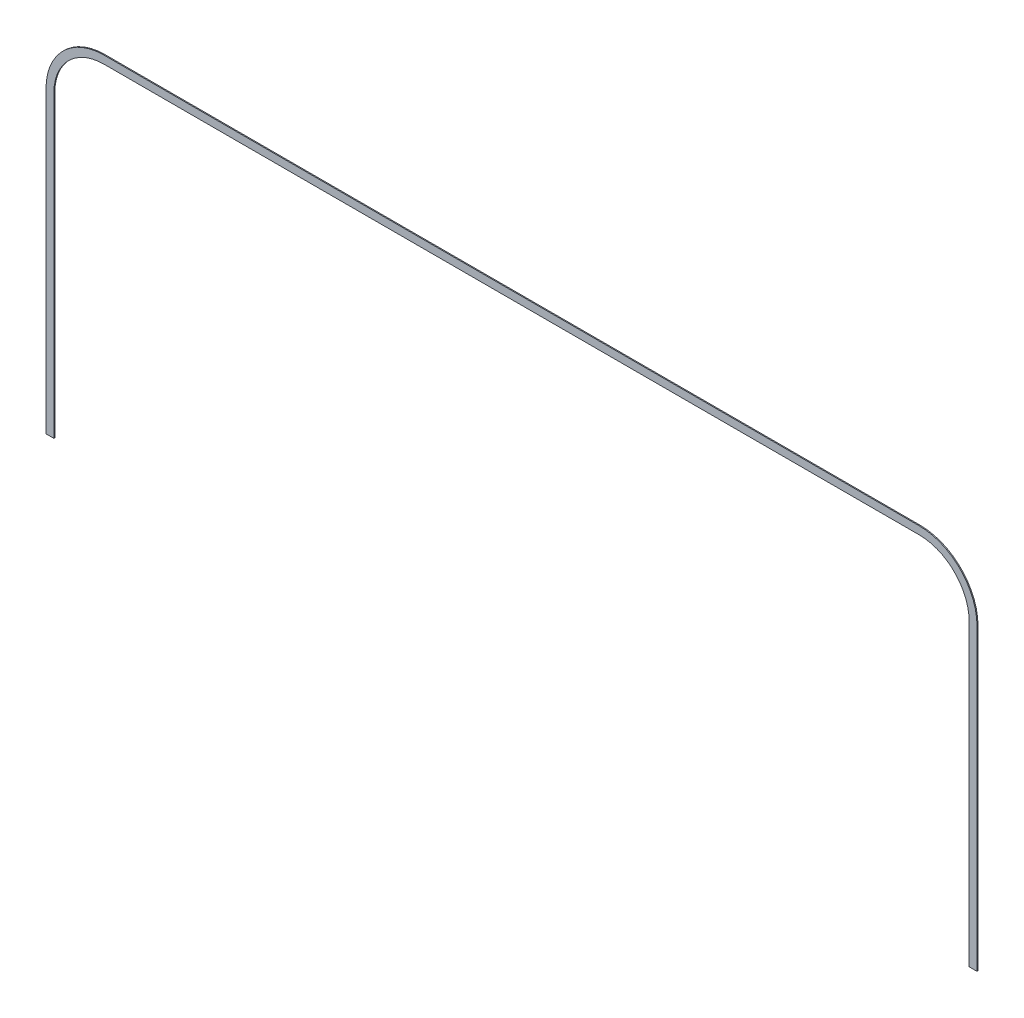
ISO-10303-21;
HEADER;
FILE_DESCRIPTION(('STEP AP214'),'2;1');
FILE_NAME('part.step','',(''),(''),'','','');
FILE_SCHEMA(('AUTOMOTIVE_DESIGN { 1 0 10303 214 1 1 1 1 }'));
ENDSEC;
DATA;
#1=APPLICATION_CONTEXT('core data for automotive mechanical design processes');
#2=APPLICATION_PROTOCOL_DEFINITION('international standard','automotive_design',2000,#1);
#3=PRODUCT_CONTEXT('',#1,'mechanical');
#4=PRODUCT('Part','Part','',(#3));
#5=PRODUCT_RELATED_PRODUCT_CATEGORY('part','',(#4));
#6=PRODUCT_DEFINITION_FORMATION('','',#4);
#7=PRODUCT_DEFINITION_CONTEXT('part definition',#1,'design');
#8=PRODUCT_DEFINITION('design','',#6,#7);
#9=PRODUCT_DEFINITION_SHAPE('','',#8);
#10=(LENGTH_UNIT() NAMED_UNIT(*) SI_UNIT(.MILLI.,.METRE.));
#11=(NAMED_UNIT(*) PLANE_ANGLE_UNIT() SI_UNIT($,.RADIAN.));
#12=(NAMED_UNIT(*) SI_UNIT($,.STERADIAN.) SOLID_ANGLE_UNIT());
#13=UNCERTAINTY_MEASURE_WITH_UNIT(LENGTH_MEASURE(1.E-05),#10,'distance_accuracy_value','');
#14=(GEOMETRIC_REPRESENTATION_CONTEXT(3) GLOBAL_UNCERTAINTY_ASSIGNED_CONTEXT((#13)) GLOBAL_UNIT_ASSIGNED_CONTEXT((#10,
#11,#12)) REPRESENTATION_CONTEXT('',''));
#15=CARTESIAN_POINT('',(0.,0.,0.));
#16=DIRECTION('',(0.,0.,1.));
#17=DIRECTION('',(1.,0.,0.));
#18=AXIS2_PLACEMENT_3D('',#15,#16,#17);
#19=CARTESIAN_POINT('',(948.,580.,80.));
#20=DIRECTION('',(-1.,0.,0.));
#21=DIRECTION('',(0.,0.,1.));
#22=AXIS2_PLACEMENT_3D('',#19,#20,#21);
#23=PLANE('',#22);
#24=DIRECTION('',(0.,-1.,0.));
#25=VECTOR('',#24,1.);
#26=CARTESIAN_POINT('',(948.,580.,82.));
#27=LINE('',#26,#25);
#28=CARTESIAN_POINT('',(948.,580.,82.));
#29=VERTEX_POINT('',#28);
#30=CARTESIAN_POINT('',(948.,-29.0000000000002,82.));
#31=VERTEX_POINT('',#30);
#32=EDGE_CURVE('E152',#29,#31,#27,.T.);
#33=ORIENTED_EDGE('',*,*,#32,.T.);
#34=DIRECTION('',(0.,0.,1.));
#35=VECTOR('',#34,1.);
#36=CARTESIAN_POINT('',(948.,-29.0000000000002,80.));
#37=LINE('',#36,#35);
#38=CARTESIAN_POINT('',(948.,-29.0000000000002,80.));
#39=VERTEX_POINT('',#38);
#40=EDGE_CURVE('E11',#39,#31,#37,.T.);
#41=ORIENTED_EDGE('',*,*,#40,.F.);
#42=DIRECTION('',(0.,-1.,0.));
#43=VECTOR('',#42,1.);
#44=CARTESIAN_POINT('',(948.,580.,80.));
#45=LINE('',#44,#43);
#46=CARTESIAN_POINT('',(948.,580.,80.));
#47=VERTEX_POINT('',#46);
#48=EDGE_CURVE('E100',#47,#39,#45,.T.);
#49=ORIENTED_EDGE('',*,*,#48,.F.);
#50=DIRECTION('',(0.,0.,1.));
#51=VECTOR('',#50,1.);
#52=CARTESIAN_POINT('',(948.,580.,80.));
#53=LINE('',#52,#51);
#54=EDGE_CURVE('E148',#47,#29,#53,.T.);
#55=ORIENTED_EDGE('',*,*,#54,.T.);
#56=EDGE_LOOP('',(#33,#41,#49,#55));
#57=FACE_BOUND('',#56,.T.);
#58=ADVANCED_FACE('F32',(#57),#23,.F.);
#59=CARTESIAN_POINT('',(932.,-29.0000000000002,80.));
#60=DIRECTION('',(0.,-1.,0.));
#61=DIRECTION('',(1.,0.,0.));
#62=AXIS2_PLACEMENT_3D('',#59,#60,#61);
#63=PLANE('',#62);
#64=DIRECTION('',(1.,0.,0.));
#65=VECTOR('',#64,1.);
#66=CARTESIAN_POINT('',(932.,-29.0000000000002,82.));
#67=LINE('',#66,#65);
#68=CARTESIAN_POINT('',(932.,-29.0000000000002,82.));
#69=VERTEX_POINT('',#68);
#70=EDGE_CURVE('E155',#69,#31,#67,.T.);
#71=ORIENTED_EDGE('',*,*,#70,.F.);
#72=DIRECTION('',(0.,0.,1.));
#73=VECTOR('',#72,1.);
#74=CARTESIAN_POINT('',(932.,-29.0000000000002,80.));
#75=LINE('',#74,#73);
#76=CARTESIAN_POINT('',(932.,-29.0000000000002,80.));
#77=VERTEX_POINT('',#76);
#78=EDGE_CURVE('E40',#77,#69,#75,.T.);
#79=ORIENTED_EDGE('',*,*,#78,.F.);
#80=DIRECTION('',(1.,0.,0.));
#81=VECTOR('',#80,1.);
#82=CARTESIAN_POINT('',(932.,-29.0000000000002,80.));
#83=LINE('',#82,#81);
#84=EDGE_CURVE('E217',#77,#39,#83,.T.);
#85=ORIENTED_EDGE('',*,*,#84,.T.);
#86=ORIENTED_EDGE('',*,*,#40,.T.);
#87=EDGE_LOOP('',(#71,#79,#85,#86));
#88=FACE_BOUND('',#87,.T.);
#89=ADVANCED_FACE('F204',(#88),#63,.T.);
#90=CARTESIAN_POINT('',(932.,580.,80.));
#91=DIRECTION('',(-1.,0.,0.));
#92=DIRECTION('',(0.,0.,1.));
#93=AXIS2_PLACEMENT_3D('',#90,#91,#92);
#94=PLANE('',#93);
#95=DIRECTION('',(0.,1.,0.));
#96=VECTOR('',#95,1.);
#97=CARTESIAN_POINT('',(932.,580.,82.));
#98=LINE('',#97,#96);
#99=CARTESIAN_POINT('',(932.,580.,82.));
#100=VERTEX_POINT('',#99);
#101=EDGE_CURVE('E158',#100,#69,#98,.F.);
#102=ORIENTED_EDGE('',*,*,#101,.F.);
#103=DIRECTION('',(0.,0.,1.));
#104=VECTOR('',#103,1.);
#105=CARTESIAN_POINT('',(932.,580.,80.));
#106=LINE('',#105,#104);
#107=CARTESIAN_POINT('',(932.,580.,80.));
#108=VERTEX_POINT('',#107);
#109=EDGE_CURVE('E194',#108,#100,#106,.T.);
#110=ORIENTED_EDGE('',*,*,#109,.F.);
#111=DIRECTION('',(0.,1.,0.));
#112=VECTOR('',#111,1.);
#113=CARTESIAN_POINT('',(932.,580.,80.));
#114=LINE('',#113,#112);
#115=EDGE_CURVE('E201',#108,#77,#114,.F.);
#116=ORIENTED_EDGE('',*,*,#115,.T.);
#117=ORIENTED_EDGE('',*,*,#78,.T.);
#118=EDGE_LOOP('',(#102,#110,#116,#117));
#119=FACE_BOUND('',#118,.T.);
#120=ADVANCED_FACE('F199',(#119),#94,.T.);
#121=CARTESIAN_POINT('',(830.,580.,80.));
#122=DIRECTION('',(0.,0.,1.));
#123=DIRECTION('',(1.,0.,0.));
#124=AXIS2_PLACEMENT_3D('',#121,#122,#123);
#125=CYLINDRICAL_SURFACE('',#124,102.);
#126=CARTESIAN_POINT('',(830.,580.,82.));
#127=DIRECTION('',(0.,0.,-1.));
#128=DIRECTION('',(-1.,0.,0.));
#129=AXIS2_PLACEMENT_3D('',#126,#127,#128);
#130=CIRCLE('',#129,102.);
#131=CARTESIAN_POINT('',(829.999999999999,682.,82.));
#132=VERTEX_POINT('',#131);
#133=EDGE_CURVE('E161',#132,#100,#130,.T.);
#134=ORIENTED_EDGE('',*,*,#133,.F.);
#135=DIRECTION('',(0.,0.,1.));
#136=VECTOR('',#135,1.);
#137=CARTESIAN_POINT('',(829.999999999999,682.,80.));
#138=LINE('',#137,#136);
#139=CARTESIAN_POINT('',(829.999999999999,682.,80.));
#140=VERTEX_POINT('',#139);
#141=EDGE_CURVE('E192',#140,#132,#138,.T.);
#142=ORIENTED_EDGE('',*,*,#141,.F.);
#143=CARTESIAN_POINT('',(830.,580.,80.));
#144=DIRECTION('',(0.,0.,-1.));
#145=DIRECTION('',(-1.,0.,0.));
#146=AXIS2_PLACEMENT_3D('',#143,#144,#145);
#147=CIRCLE('',#146,102.);
#148=EDGE_CURVE('E214',#140,#108,#147,.T.);
#149=ORIENTED_EDGE('',*,*,#148,.T.);
#150=ORIENTED_EDGE('',*,*,#109,.T.);
#151=EDGE_LOOP('',(#134,#142,#149,#150));
#152=FACE_BOUND('',#151,.T.);
#153=ADVANCED_FACE('F211',(#152),#125,.F.);
#154=CARTESIAN_POINT('',(-829.999999999999,682.,80.));
#155=DIRECTION('',(0.,-1.,0.));
#156=DIRECTION('',(0.,0.,-1.));
#157=AXIS2_PLACEMENT_3D('',#154,#155,#156);
#158=PLANE('',#157);
#159=DIRECTION('',(-1.,0.,0.));
#160=VECTOR('',#159,1.);
#161=CARTESIAN_POINT('',(-829.999999999999,682.,82.));
#162=LINE('',#161,#160);
#163=CARTESIAN_POINT('',(-829.999999999999,682.,82.));
#164=VERTEX_POINT('',#163);
#165=EDGE_CURVE('E164',#164,#132,#162,.F.);
#166=ORIENTED_EDGE('',*,*,#165,.F.);
#167=DIRECTION('',(0.,0.,1.));
#168=VECTOR('',#167,1.);
#169=CARTESIAN_POINT('',(-829.999999999999,682.,80.));
#170=LINE('',#169,#168);
#171=CARTESIAN_POINT('',(-829.999999999999,682.,80.));
#172=VERTEX_POINT('',#171);
#173=EDGE_CURVE('E190',#172,#164,#170,.T.);
#174=ORIENTED_EDGE('',*,*,#173,.F.);
#175=DIRECTION('',(-1.,0.,0.));
#176=VECTOR('',#175,1.);
#177=CARTESIAN_POINT('',(-829.999999999999,682.,80.));
#178=LINE('',#177,#176);
#179=EDGE_CURVE('E219',#172,#140,#178,.F.);
#180=ORIENTED_EDGE('',*,*,#179,.T.);
#181=ORIENTED_EDGE('',*,*,#141,.T.);
#182=EDGE_LOOP('',(#166,#174,#180,#181));
#183=FACE_BOUND('',#182,.T.);
#184=ADVANCED_FACE('F323',(#183),#158,.T.);
#185=CARTESIAN_POINT('',(-830.,580.,80.));
#186=DIRECTION('',(0.,0.,1.));
#187=DIRECTION('',(1.,0.,0.));
#188=AXIS2_PLACEMENT_3D('',#185,#186,#187);
#189=CYLINDRICAL_SURFACE('',#188,102.);
#190=CARTESIAN_POINT('',(-830.,580.,82.));
#191=DIRECTION('',(0.,0.,-1.));
#192=DIRECTION('',(-1.,0.,0.));
#193=AXIS2_PLACEMENT_3D('',#190,#191,#192);
#194=CIRCLE('',#193,102.);
#195=CARTESIAN_POINT('',(-932.,579.999999999999,82.));
#196=VERTEX_POINT('',#195);
#197=EDGE_CURVE('E167',#196,#164,#194,.T.);
#198=ORIENTED_EDGE('',*,*,#197,.F.);
#199=DIRECTION('',(0.,0.,1.));
#200=VECTOR('',#199,1.);
#201=CARTESIAN_POINT('',(-932.,579.999999999999,80.));
#202=LINE('',#201,#200);
#203=CARTESIAN_POINT('',(-932.,579.999999999999,80.));
#204=VERTEX_POINT('',#203);
#205=EDGE_CURVE('E188',#204,#196,#202,.T.);
#206=ORIENTED_EDGE('',*,*,#205,.F.);
#207=CARTESIAN_POINT('',(-830.,580.,80.));
#208=DIRECTION('',(0.,0.,-1.));
#209=DIRECTION('',(-1.,0.,0.));
#210=AXIS2_PLACEMENT_3D('',#207,#208,#209);
#211=CIRCLE('',#210,102.);
#212=EDGE_CURVE('E225',#204,#172,#211,.T.);
#213=ORIENTED_EDGE('',*,*,#212,.T.);
#214=ORIENTED_EDGE('',*,*,#173,.T.);
#215=EDGE_LOOP('',(#198,#206,#213,#214));
#216=FACE_BOUND('',#215,.T.);
#217=ADVANCED_FACE('F314',(#216),#189,.F.);
#218=CARTESIAN_POINT('',(-932.,-29.0000000000002,80.));
#219=DIRECTION('',(1.,0.,0.));
#220=DIRECTION('',(0.,0.,-1.));
#221=AXIS2_PLACEMENT_3D('',#218,#219,#220);
#222=PLANE('',#221);
#223=DIRECTION('',(0.,1.,0.));
#224=VECTOR('',#223,1.);
#225=CARTESIAN_POINT('',(-932.,-29.0000000000002,82.));
#226=LINE('',#225,#224);
#227=CARTESIAN_POINT('',(-932.,-29.0000000000002,82.));
#228=VERTEX_POINT('',#227);
#229=EDGE_CURVE('E170',#228,#196,#226,.T.);
#230=ORIENTED_EDGE('',*,*,#229,.F.);
#231=DIRECTION('',(0.,0.,1.));
#232=VECTOR('',#231,1.);
#233=CARTESIAN_POINT('',(-932.,-29.0000000000002,80.));
#234=LINE('',#233,#232);
#235=CARTESIAN_POINT('',(-932.,-29.0000000000002,80.));
#236=VERTEX_POINT('',#235);
#237=EDGE_CURVE('E186',#236,#228,#234,.T.);
#238=ORIENTED_EDGE('',*,*,#237,.F.);
#239=DIRECTION('',(0.,1.,0.));
#240=VECTOR('',#239,1.);
#241=CARTESIAN_POINT('',(-932.,-29.0000000000002,80.));
#242=LINE('',#241,#240);
#243=EDGE_CURVE('E228',#236,#204,#242,.T.);
#244=ORIENTED_EDGE('',*,*,#243,.T.);
#245=ORIENTED_EDGE('',*,*,#205,.T.);
#246=EDGE_LOOP('',(#230,#238,#244,#245));
#247=FACE_BOUND('',#246,.T.);
#248=ADVANCED_FACE('F240',(#247),#222,.T.);
#249=CARTESIAN_POINT('',(-948.,-29.0000000000002,80.));
#250=DIRECTION('',(0.,-1.,0.));
#251=DIRECTION('',(0.,0.,-1.));
#252=AXIS2_PLACEMENT_3D('',#249,#250,#251);
#253=PLANE('',#252);
#254=DIRECTION('',(1.,0.,0.));
#255=VECTOR('',#254,1.);
#256=CARTESIAN_POINT('',(-948.,-29.0000000000002,82.));
#257=LINE('',#256,#255);
#258=CARTESIAN_POINT('',(-948.,-29.0000000000002,82.));
#259=VERTEX_POINT('',#258);
#260=EDGE_CURVE('E173',#259,#228,#257,.T.);
#261=ORIENTED_EDGE('',*,*,#260,.F.);
#262=DIRECTION('',(0.,0.,1.));
#263=VECTOR('',#262,1.);
#264=CARTESIAN_POINT('',(-948.,-29.0000000000002,80.));
#265=LINE('',#264,#263);
#266=CARTESIAN_POINT('',(-948.,-29.0000000000002,80.));
#267=VERTEX_POINT('',#266);
#268=EDGE_CURVE('E184',#267,#259,#265,.T.);
#269=ORIENTED_EDGE('',*,*,#268,.F.);
#270=DIRECTION('',(1.,0.,0.));
#271=VECTOR('',#270,1.);
#272=CARTESIAN_POINT('',(-948.,-29.0000000000002,80.));
#273=LINE('',#272,#271);
#274=EDGE_CURVE('E231',#267,#236,#273,.T.);
#275=ORIENTED_EDGE('',*,*,#274,.T.);
#276=ORIENTED_EDGE('',*,*,#237,.T.);
#277=EDGE_LOOP('',(#261,#269,#275,#276));
#278=FACE_BOUND('',#277,.T.);
#279=ADVANCED_FACE('F235',(#278),#253,.T.);
#280=CARTESIAN_POINT('',(-948.,-29.0000000000002,80.));
#281=DIRECTION('',(1.,0.,0.));
#282=DIRECTION('',(0.,0.,-1.));
#283=AXIS2_PLACEMENT_3D('',#280,#281,#282);
#284=PLANE('',#283);
#285=DIRECTION('',(0.,1.,0.));
#286=VECTOR('',#285,1.);
#287=CARTESIAN_POINT('',(-948.,-29.0000000000002,82.));
#288=LINE('',#287,#286);
#289=CARTESIAN_POINT('',(-948.,579.999999999999,82.));
#290=VERTEX_POINT('',#289);
#291=EDGE_CURVE('E176',#259,#290,#288,.T.);
#292=ORIENTED_EDGE('',*,*,#291,.T.);
#293=DIRECTION('',(0.,0.,1.));
#294=VECTOR('',#293,1.);
#295=CARTESIAN_POINT('',(-948.,579.999999999999,80.));
#296=LINE('',#295,#294);
#297=CARTESIAN_POINT('',(-948.,579.999999999999,80.));
#298=VERTEX_POINT('',#297);
#299=EDGE_CURVE('E143',#298,#290,#296,.T.);
#300=ORIENTED_EDGE('',*,*,#299,.F.);
#301=DIRECTION('',(0.,1.,0.));
#302=VECTOR('',#301,1.);
#303=CARTESIAN_POINT('',(-948.,-29.0000000000002,80.));
#304=LINE('',#303,#302);
#305=EDGE_CURVE('E134',#267,#298,#304,.T.);
#306=ORIENTED_EDGE('',*,*,#305,.F.);
#307=ORIENTED_EDGE('',*,*,#268,.T.);
#308=EDGE_LOOP('',(#292,#300,#306,#307));
#309=FACE_BOUND('',#308,.T.);
#310=ADVANCED_FACE('F244',(#309),#284,.F.);
#311=CARTESIAN_POINT('',(-830.,580.,80.));
#312=DIRECTION('',(0.,0.,1.));
#313=DIRECTION('',(1.,0.,0.));
#314=AXIS2_PLACEMENT_3D('',#311,#312,#313);
#315=CYLINDRICAL_SURFACE('',#314,118.);
#316=CARTESIAN_POINT('',(-830.,580.,82.));
#317=DIRECTION('',(0.,0.,-1.));
#318=DIRECTION('',(-1.,0.,0.));
#319=AXIS2_PLACEMENT_3D('',#316,#317,#318);
#320=CIRCLE('',#319,118.);
#321=CARTESIAN_POINT('',(-829.999999999999,698.,82.));
#322=VERTEX_POINT('',#321);
#323=EDGE_CURVE('E142',#290,#322,#320,.T.);
#324=ORIENTED_EDGE('',*,*,#323,.T.);
#325=DIRECTION('',(0.,0.,1.));
#326=VECTOR('',#325,1.);
#327=CARTESIAN_POINT('',(-829.999999999999,698.,80.));
#328=LINE('',#327,#326);
#329=CARTESIAN_POINT('',(-829.999999999999,698.,80.));
#330=VERTEX_POINT('',#329);
#331=EDGE_CURVE('E139',#330,#322,#328,.T.);
#332=ORIENTED_EDGE('',*,*,#331,.F.);
#333=CARTESIAN_POINT('',(-830.,580.,80.));
#334=DIRECTION('',(0.,0.,-1.));
#335=DIRECTION('',(-1.,0.,0.));
#336=AXIS2_PLACEMENT_3D('',#333,#334,#335);
#337=CIRCLE('',#336,118.);
#338=EDGE_CURVE('E127',#298,#330,#337,.T.);
#339=ORIENTED_EDGE('',*,*,#338,.F.);
#340=ORIENTED_EDGE('',*,*,#299,.T.);
#341=EDGE_LOOP('',(#324,#332,#339,#340));
#342=FACE_BOUND('',#341,.T.);
#343=ADVANCED_FACE('F140',(#342),#315,.T.);
#344=CARTESIAN_POINT('',(-829.999999999999,698.,80.));
#345=DIRECTION('',(0.,-1.,0.));
#346=DIRECTION('',(0.,0.,-1.));
#347=AXIS2_PLACEMENT_3D('',#344,#345,#346);
#348=PLANE('',#347);
#349=DIRECTION('',(1.,0.,0.));
#350=VECTOR('',#349,1.);
#351=CARTESIAN_POINT('',(-829.999999999999,698.,82.));
#352=LINE('',#351,#350);
#353=CARTESIAN_POINT('',(829.999999999999,698.,82.));
#354=VERTEX_POINT('',#353);
#355=EDGE_CURVE('E88',#322,#354,#352,.T.);
#356=ORIENTED_EDGE('',*,*,#355,.T.);
#357=DIRECTION('',(0.,0.,1.));
#358=VECTOR('',#357,1.);
#359=CARTESIAN_POINT('',(829.999999999999,698.,80.));
#360=LINE('',#359,#358);
#361=CARTESIAN_POINT('',(829.999999999999,698.,80.));
#362=VERTEX_POINT('',#361);
#363=EDGE_CURVE('E144',#362,#354,#360,.T.);
#364=ORIENTED_EDGE('',*,*,#363,.F.);
#365=DIRECTION('',(1.,0.,0.));
#366=VECTOR('',#365,1.);
#367=CARTESIAN_POINT('',(-829.999999999999,698.,80.));
#368=LINE('',#367,#366);
#369=EDGE_CURVE('E131',#330,#362,#368,.T.);
#370=ORIENTED_EDGE('',*,*,#369,.F.);
#371=ORIENTED_EDGE('',*,*,#331,.T.);
#372=EDGE_LOOP('',(#356,#364,#370,#371));
#373=FACE_BOUND('',#372,.T.);
#374=ADVANCED_FACE('F146',(#373),#348,.F.);
#375=CARTESIAN_POINT('',(830.,580.,80.));
#376=DIRECTION('',(0.,0.,1.));
#377=DIRECTION('',(1.,0.,0.));
#378=AXIS2_PLACEMENT_3D('',#375,#376,#377);
#379=CYLINDRICAL_SURFACE('',#378,118.);
#380=CARTESIAN_POINT('',(830.,580.,82.));
#381=DIRECTION('',(0.,0.,-1.));
#382=DIRECTION('',(-1.,0.,0.));
#383=AXIS2_PLACEMENT_3D('',#380,#381,#382);
#384=CIRCLE('',#383,118.);
#385=EDGE_CURVE('E94',#354,#29,#384,.T.);
#386=ORIENTED_EDGE('',*,*,#385,.T.);
#387=ORIENTED_EDGE('',*,*,#54,.F.);
#388=CARTESIAN_POINT('',(830.,580.,80.));
#389=DIRECTION('',(0.,0.,-1.));
#390=DIRECTION('',(-1.,0.,0.));
#391=AXIS2_PLACEMENT_3D('',#388,#389,#390);
#392=CIRCLE('',#391,118.);
#393=EDGE_CURVE('E48',#362,#47,#392,.T.);
#394=ORIENTED_EDGE('',*,*,#393,.F.);
#395=ORIENTED_EDGE('',*,*,#363,.T.);
#396=EDGE_LOOP('',(#386,#387,#394,#395));
#397=FACE_BOUND('',#396,.T.);
#398=ADVANCED_FACE('F258',(#397),#379,.T.);
#399=CARTESIAN_POINT('',(830.,580.,80.));
#400=DIRECTION('',(0.,0.,-1.));
#401=DIRECTION('',(-1.,0.,0.));
#402=AXIS2_PLACEMENT_3D('',#399,#400,#401);
#403=PLANE('',#402);
#404=ORIENTED_EDGE('',*,*,#48,.T.);
#405=ORIENTED_EDGE('',*,*,#84,.F.);
#406=ORIENTED_EDGE('',*,*,#115,.F.);
#407=ORIENTED_EDGE('',*,*,#148,.F.);
#408=ORIENTED_EDGE('',*,*,#179,.F.);
#409=ORIENTED_EDGE('',*,*,#212,.F.);
#410=ORIENTED_EDGE('',*,*,#243,.F.);
#411=ORIENTED_EDGE('',*,*,#274,.F.);
#412=ORIENTED_EDGE('',*,*,#305,.T.);
#413=ORIENTED_EDGE('',*,*,#338,.T.);
#414=ORIENTED_EDGE('',*,*,#369,.T.);
#415=ORIENTED_EDGE('',*,*,#393,.T.);
#416=EDGE_LOOP('',(#404,#405,#406,#407,#408,#409,#410,#411,#412,#413,#414,#415));
#417=FACE_BOUND('',#416,.T.);
#418=ADVANCED_FACE('F129',(#417),#403,.T.);
#419=CARTESIAN_POINT('',(830.,580.,82.));
#420=DIRECTION('',(0.,0.,-1.));
#421=DIRECTION('',(-1.,0.,0.));
#422=AXIS2_PLACEMENT_3D('',#419,#420,#421);
#423=PLANE('',#422);
#424=ORIENTED_EDGE('',*,*,#32,.F.);
#425=ORIENTED_EDGE('',*,*,#385,.F.);
#426=ORIENTED_EDGE('',*,*,#355,.F.);
#427=ORIENTED_EDGE('',*,*,#323,.F.);
#428=ORIENTED_EDGE('',*,*,#291,.F.);
#429=ORIENTED_EDGE('',*,*,#260,.T.);
#430=ORIENTED_EDGE('',*,*,#229,.T.);
#431=ORIENTED_EDGE('',*,*,#197,.T.);
#432=ORIENTED_EDGE('',*,*,#165,.T.);
#433=ORIENTED_EDGE('',*,*,#133,.T.);
#434=ORIENTED_EDGE('',*,*,#101,.T.);
#435=ORIENTED_EDGE('',*,*,#70,.T.);
#436=EDGE_LOOP('',(#424,#425,#426,#427,#428,#429,#430,#431,#432,#433,#434,#435));
#437=FACE_BOUND('',#436,.T.);
#438=ADVANCED_FACE('F207',(#437),#423,.F.);
#439=CLOSED_SHELL('',(#58,#89,#120,#153,#184,#217,#248,#279,#310,#343,#374,#398,#418,#438));
#440=MANIFOLD_SOLID_BREP('B2',#439);
#441=ADVANCED_BREP_SHAPE_REPRESENTATION('',(#18,#440),#14);
#442=SHAPE_DEFINITION_REPRESENTATION(#9,#441);
ENDSEC;
END-ISO-10303-21;
